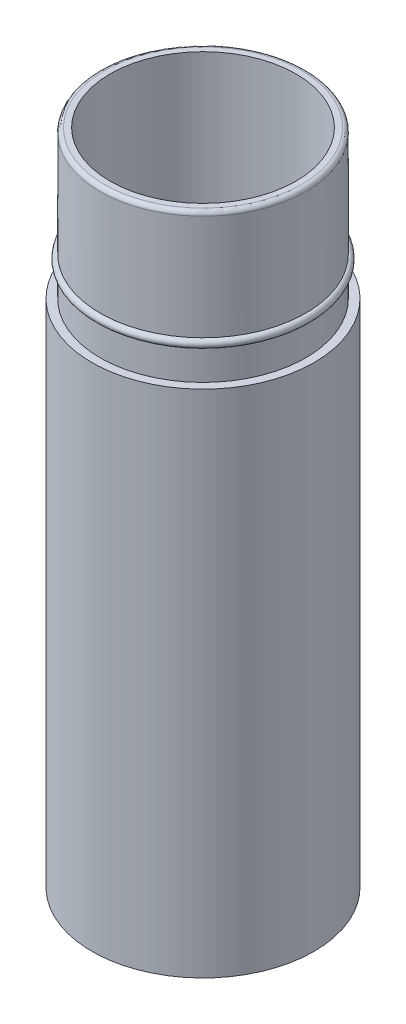
ISO-10303-21;
HEADER;
FILE_DESCRIPTION(('STEP AP214'),'2;1');
FILE_NAME('part.step','',(''),(''),'','','');
FILE_SCHEMA(('AUTOMOTIVE_DESIGN { 1 0 10303 214 1 1 1 1 }'));
ENDSEC;
DATA;
#1=APPLICATION_CONTEXT('core data for automotive mechanical design processes');
#2=APPLICATION_PROTOCOL_DEFINITION('international standard','automotive_design',2000,#1);
#3=PRODUCT_CONTEXT('',#1,'mechanical');
#4=PRODUCT('Part','Part','',(#3));
#5=PRODUCT_RELATED_PRODUCT_CATEGORY('part','',(#4));
#6=PRODUCT_DEFINITION_FORMATION('','',#4);
#7=PRODUCT_DEFINITION_CONTEXT('part definition',#1,'design');
#8=PRODUCT_DEFINITION('design','',#6,#7);
#9=PRODUCT_DEFINITION_SHAPE('','',#8);
#10=(LENGTH_UNIT() NAMED_UNIT(*) SI_UNIT(.MILLI.,.METRE.));
#11=(NAMED_UNIT(*) PLANE_ANGLE_UNIT() SI_UNIT($,.RADIAN.));
#12=(NAMED_UNIT(*) SI_UNIT($,.STERADIAN.) SOLID_ANGLE_UNIT());
#13=UNCERTAINTY_MEASURE_WITH_UNIT(LENGTH_MEASURE(1.E-05),#10,'distance_accuracy_value','');
#14=(GEOMETRIC_REPRESENTATION_CONTEXT(3) GLOBAL_UNCERTAINTY_ASSIGNED_CONTEXT((#13)) GLOBAL_UNIT_ASSIGNED_CONTEXT((#10,
#11,#12)) REPRESENTATION_CONTEXT('',''));
#15=CARTESIAN_POINT('',(0.,0.,0.));
#16=DIRECTION('',(0.,0.,1.));
#17=DIRECTION('',(1.,0.,0.));
#18=AXIS2_PLACEMENT_3D('',#15,#16,#17);
#19=CARTESIAN_POINT('',(11.3,0.,0.));
#20=DIRECTION('',(0.,1.,0.));
#21=DIRECTION('',(-1.,0.,0.));
#22=AXIS2_PLACEMENT_3D('',#19,#20,#21);
#23=PLANE('',#22);
#24=CARTESIAN_POINT('',(0.,0.,0.));
#25=DIRECTION('',(0.,1.,0.));
#26=DIRECTION('',(-1.,0.,0.));
#27=AXIS2_PLACEMENT_3D('',#24,#25,#26);
#28=CIRCLE('',#27,13.5);
#29=CARTESIAN_POINT('',(-13.5,0.,0.));
#30=VERTEX_POINT('',#29);
#31=EDGE_CURVE('E62',#30,#30,#28,.T.);
#32=ORIENTED_EDGE('',*,*,#31,.F.);
#33=EDGE_LOOP('',(#32));
#34=FACE_BOUND('',#33,.T.);
#35=CARTESIAN_POINT('',(0.,0.,0.));
#36=DIRECTION('',(0.,1.,0.));
#37=DIRECTION('',(-1.,0.,0.));
#38=AXIS2_PLACEMENT_3D('',#35,#36,#37);
#39=CIRCLE('',#38,11.3);
#40=CARTESIAN_POINT('',(-11.3,0.,0.));
#41=VERTEX_POINT('',#40);
#42=EDGE_CURVE('E41',#41,#41,#39,.T.);
#43=ORIENTED_EDGE('',*,*,#42,.T.);
#44=EDGE_LOOP('',(#43));
#45=FACE_BOUND('',#44,.T.);
#46=ADVANCED_FACE('F30',(#34,#45),#23,.F.);
#47=CARTESIAN_POINT('',(0.,52.2625000000001,0.));
#48=DIRECTION('',(0.,1.,0.));
#49=DIRECTION('',(-1.,0.,0.));
#50=AXIS2_PLACEMENT_3D('',#47,#48,#49);
#51=CYLINDRICAL_SURFACE('',#50,11.3);
#52=ORIENTED_EDGE('',*,*,#42,.F.);
#53=EDGE_LOOP('',(#52));
#54=FACE_BOUND('',#53,.T.);
#55=CARTESIAN_POINT('',(0.,80.,0.));
#56=DIRECTION('',(0.,1.,0.));
#57=DIRECTION('',(-1.,0.,0.));
#58=AXIS2_PLACEMENT_3D('',#55,#56,#57);
#59=CIRCLE('',#58,11.3);
#60=CARTESIAN_POINT('',(-11.3,80.,0.));
#61=VERTEX_POINT('',#60);
#62=EDGE_CURVE('E45',#61,#61,#59,.T.);
#63=ORIENTED_EDGE('',*,*,#62,.T.);
#64=EDGE_LOOP('',(#63));
#65=FACE_BOUND('',#64,.T.);
#66=ADVANCED_FACE('F70',(#54,#65),#51,.F.);
#67=CARTESIAN_POINT('',(11.3,80.,0.));
#68=DIRECTION('',(0.,-1.,0.));
#69=DIRECTION('',(1.,0.,0.));
#70=AXIS2_PLACEMENT_3D('',#67,#68,#69);
#71=PLANE('',#70);
#72=CARTESIAN_POINT('',(0.,80.,0.));
#73=DIRECTION('',(0.,-1.,0.));
#74=DIRECTION('',(1.,0.,0.));
#75=AXIS2_PLACEMENT_3D('',#72,#73,#74);
#76=CIRCLE('',#75,12.);
#77=CARTESIAN_POINT('',(12.,80.,0.));
#78=VERTEX_POINT('',#77);
#79=EDGE_CURVE('E37',#78,#78,#76,.F.);
#80=ORIENTED_EDGE('',*,*,#79,.T.);
#81=EDGE_LOOP('',(#80));
#82=FACE_BOUND('',#81,.T.);
#83=ORIENTED_EDGE('',*,*,#62,.F.);
#84=EDGE_LOOP('',(#83));
#85=FACE_BOUND('',#84,.T.);
#86=ADVANCED_FACE('F75',(#82,#85),#71,.F.);
#87=CARTESIAN_POINT('',(0.,52.2625000000001,0.));
#88=DIRECTION('',(0.,1.,0.));
#89=DIRECTION('',(-1.,0.,0.));
#90=AXIS2_PLACEMENT_3D('',#87,#88,#89);
#91=CYLINDRICAL_SURFACE('',#90,12.5);
#92=CARTESIAN_POINT('',(0.,79.5,0.));
#93=DIRECTION('',(0.,-1.,0.));
#94=DIRECTION('',(1.,0.,0.));
#95=AXIS2_PLACEMENT_3D('',#92,#93,#94);
#96=CIRCLE('',#95,12.5);
#97=CARTESIAN_POINT('',(12.5,79.5,0.));
#98=VERTEX_POINT('',#97);
#99=EDGE_CURVE('E10',#98,#98,#96,.T.);
#100=ORIENTED_EDGE('',*,*,#99,.T.);
#101=EDGE_LOOP('',(#100));
#102=FACE_BOUND('',#101,.T.);
#103=CARTESIAN_POINT('',(0.,66.7,0.));
#104=DIRECTION('',(0.,1.,0.));
#105=DIRECTION('',(-1.,0.,0.));
#106=AXIS2_PLACEMENT_3D('',#103,#104,#105);
#107=CIRCLE('',#106,12.5);
#108=CARTESIAN_POINT('',(-12.5,66.7,0.));
#109=VERTEX_POINT('',#108);
#110=EDGE_CURVE('E50',#109,#109,#107,.T.);
#111=ORIENTED_EDGE('',*,*,#110,.T.);
#112=EDGE_LOOP('',(#111));
#113=FACE_BOUND('',#112,.T.);
#114=ADVANCED_FACE('F80',(#102,#113),#91,.T.);
#115=CARTESIAN_POINT('',(0.,66.2,0.));
#116=DIRECTION('',(0.,1.,0.));
#117=DIRECTION('',(-1.,0.,0.));
#118=AXIS2_PLACEMENT_3D('',#115,#116,#117);
#119=TOROIDAL_SURFACE('',#118,12.5,0.5);
#120=ORIENTED_EDGE('',*,*,#110,.F.);
#121=EDGE_LOOP('',(#120));
#122=FACE_BOUND('',#121,.T.);
#123=CARTESIAN_POINT('',(0.,65.7,0.));
#124=DIRECTION('',(0.,1.,0.));
#125=DIRECTION('',(-1.,0.,0.));
#126=AXIS2_PLACEMENT_3D('',#123,#124,#125);
#127=CIRCLE('',#126,12.5);
#128=CARTESIAN_POINT('',(-12.5,65.7,0.));
#129=VERTEX_POINT('',#128);
#130=EDGE_CURVE('E53',#129,#129,#127,.T.);
#131=ORIENTED_EDGE('',*,*,#130,.T.);
#132=EDGE_LOOP('',(#131));
#133=FACE_BOUND('',#132,.T.);
#134=ADVANCED_FACE('F85',(#122,#133),#119,.T.);
#135=CARTESIAN_POINT('',(0.,52.2625000000001,0.));
#136=DIRECTION('',(0.,1.,0.));
#137=DIRECTION('',(-1.,0.,0.));
#138=AXIS2_PLACEMENT_3D('',#135,#136,#137);
#139=CYLINDRICAL_SURFACE('',#138,12.5);
#140=ORIENTED_EDGE('',*,*,#130,.F.);
#141=EDGE_LOOP('',(#140));
#142=FACE_BOUND('',#141,.T.);
#143=CARTESIAN_POINT('',(0.,62.,0.));
#144=DIRECTION('',(0.,1.,0.));
#145=DIRECTION('',(-1.,0.,0.));
#146=AXIS2_PLACEMENT_3D('',#143,#144,#145);
#147=CIRCLE('',#146,12.5);
#148=CARTESIAN_POINT('',(-12.5,62.,0.));
#149=VERTEX_POINT('',#148);
#150=EDGE_CURVE('E56',#149,#149,#147,.T.);
#151=ORIENTED_EDGE('',*,*,#150,.T.);
#152=EDGE_LOOP('',(#151));
#153=FACE_BOUND('',#152,.T.);
#154=ADVANCED_FACE('F90',(#142,#153),#139,.T.);
#155=CARTESIAN_POINT('',(13.5,62.,0.));
#156=DIRECTION('',(0.,-1.,0.));
#157=DIRECTION('',(1.,0.,0.));
#158=AXIS2_PLACEMENT_3D('',#155,#156,#157);
#159=PLANE('',#158);
#160=ORIENTED_EDGE('',*,*,#150,.F.);
#161=EDGE_LOOP('',(#160));
#162=FACE_BOUND('',#161,.T.);
#163=CARTESIAN_POINT('',(0.,62.,0.));
#164=DIRECTION('',(0.,1.,0.));
#165=DIRECTION('',(-1.,0.,0.));
#166=AXIS2_PLACEMENT_3D('',#163,#164,#165);
#167=CIRCLE('',#166,13.5);
#168=CARTESIAN_POINT('',(-13.5,62.,0.));
#169=VERTEX_POINT('',#168);
#170=EDGE_CURVE('E59',#169,#169,#167,.T.);
#171=ORIENTED_EDGE('',*,*,#170,.T.);
#172=EDGE_LOOP('',(#171));
#173=FACE_BOUND('',#172,.T.);
#174=ADVANCED_FACE('F94',(#162,#173),#159,.F.);
#175=CARTESIAN_POINT('',(0.,52.2625000000001,0.));
#176=DIRECTION('',(0.,1.,0.));
#177=DIRECTION('',(-1.,0.,0.));
#178=AXIS2_PLACEMENT_3D('',#175,#176,#177);
#179=CYLINDRICAL_SURFACE('',#178,13.5);
#180=ORIENTED_EDGE('',*,*,#170,.F.);
#181=EDGE_LOOP('',(#180));
#182=FACE_BOUND('',#181,.T.);
#183=ORIENTED_EDGE('',*,*,#31,.T.);
#184=EDGE_LOOP('',(#183));
#185=FACE_BOUND('',#184,.T.);
#186=ADVANCED_FACE('F66',(#182,#185),#179,.T.);
#187=CARTESIAN_POINT('',(0.,79.5,0.));
#188=DIRECTION('',(0.,-1.,0.));
#189=DIRECTION('',(1.,0.,0.));
#190=AXIS2_PLACEMENT_3D('',#187,#188,#189);
#191=TOROIDAL_SURFACE('',#190,12.,0.5);
#192=ORIENTED_EDGE('',*,*,#99,.F.);
#193=EDGE_LOOP('',(#192));
#194=FACE_BOUND('',#193,.T.);
#195=ORIENTED_EDGE('',*,*,#79,.F.);
#196=EDGE_LOOP('',(#195));
#197=FACE_BOUND('',#196,.T.);
#198=ADVANCED_FACE('F32',(#194,#197),#191,.T.);
#199=CLOSED_SHELL('',(#46,#66,#86,#114,#134,#154,#174,#186,#198));
#200=MANIFOLD_SOLID_BREP('B2',#199);
#201=ADVANCED_BREP_SHAPE_REPRESENTATION('',(#18,#200),#14);
#202=SHAPE_DEFINITION_REPRESENTATION(#9,#201);
ENDSEC;
END-ISO-10303-21;
